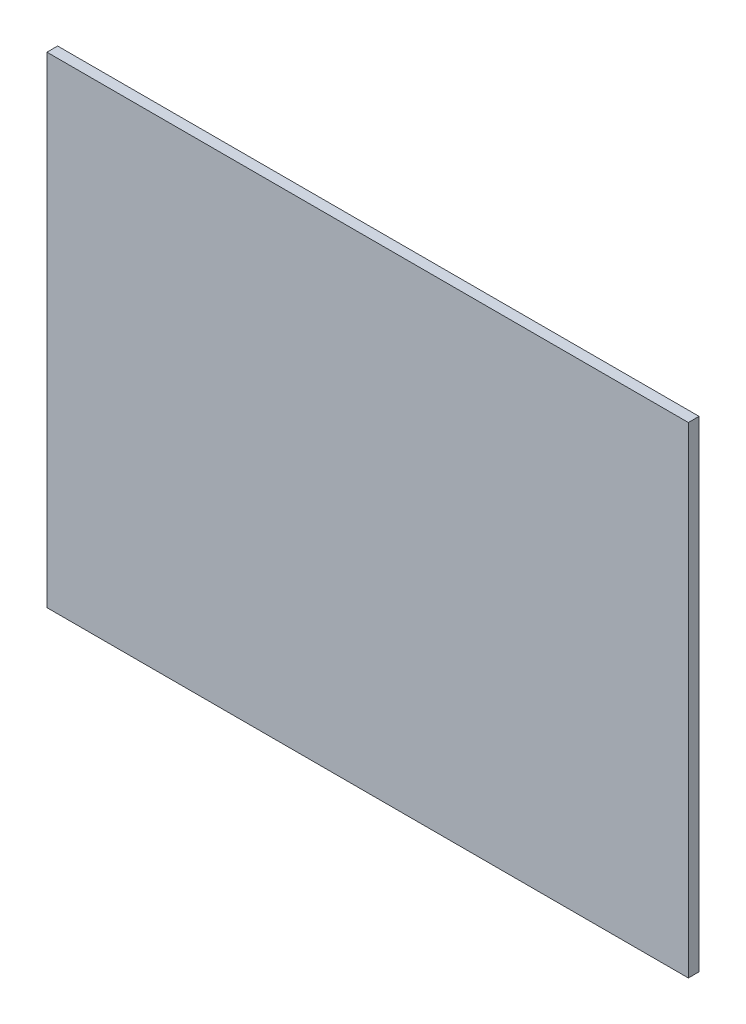
ISO-10303-21;
HEADER;
FILE_DESCRIPTION(('STEP AP214'),'2;1');
FILE_NAME('part.step','',(''),(''),'','','');
FILE_SCHEMA(('AUTOMOTIVE_DESIGN { 1 0 10303 214 1 1 1 1 }'));
ENDSEC;
DATA;
#1=APPLICATION_CONTEXT('core data for automotive mechanical design processes');
#2=APPLICATION_PROTOCOL_DEFINITION('international standard','automotive_design',2000,#1);
#3=PRODUCT_CONTEXT('',#1,'mechanical');
#4=PRODUCT('Part','Part','',(#3));
#5=PRODUCT_RELATED_PRODUCT_CATEGORY('part','',(#4));
#6=PRODUCT_DEFINITION_FORMATION('','',#4);
#7=PRODUCT_DEFINITION_CONTEXT('part definition',#1,'design');
#8=PRODUCT_DEFINITION('design','',#6,#7);
#9=PRODUCT_DEFINITION_SHAPE('','',#8);
#10=(LENGTH_UNIT() NAMED_UNIT(*) SI_UNIT(.MILLI.,.METRE.));
#11=(NAMED_UNIT(*) PLANE_ANGLE_UNIT() SI_UNIT($,.RADIAN.));
#12=(NAMED_UNIT(*) SI_UNIT($,.STERADIAN.) SOLID_ANGLE_UNIT());
#13=UNCERTAINTY_MEASURE_WITH_UNIT(LENGTH_MEASURE(1.E-05),#10,'distance_accuracy_value','');
#14=(GEOMETRIC_REPRESENTATION_CONTEXT(3) GLOBAL_UNCERTAINTY_ASSIGNED_CONTEXT((#13)) GLOBAL_UNIT_ASSIGNED_CONTEXT((#10,
#11,#12)) REPRESENTATION_CONTEXT('',''));
#15=CARTESIAN_POINT('',(0.,0.,0.));
#16=DIRECTION('',(0.,0.,1.));
#17=DIRECTION('',(1.,0.,0.));
#18=AXIS2_PLACEMENT_3D('',#15,#16,#17);
#19=CARTESIAN_POINT('',(-61.8017838452004,-407.030121654501,10.));
#20=DIRECTION('',(1.,0.,0.));
#21=DIRECTION('',(0.,0.,-1.));
#22=AXIS2_PLACEMENT_3D('',#19,#20,#21);
#23=PLANE('',#22);
#24=DIRECTION('',(0.,-1.,0.));
#25=VECTOR('',#24,1.);
#26=CARTESIAN_POINT('',(-61.8017838452004,-407.030121654501,0.));
#27=LINE('',#26,#25);
#28=CARTESIAN_POINT('',(-61.8017838452004,42.9698783454988,0.));
#29=VERTEX_POINT('',#28);
#30=CARTESIAN_POINT('',(-61.8017838452004,-407.030121654501,0.));
#31=VERTEX_POINT('',#30);
#32=EDGE_CURVE('E96',#29,#31,#27,.T.);
#33=ORIENTED_EDGE('',*,*,#32,.T.);
#34=DIRECTION('',(0.,0.,-1.));
#35=VECTOR('',#34,1.);
#36=CARTESIAN_POINT('',(-61.8017838452004,-407.030121654501,10.));
#37=LINE('',#36,#35);
#38=CARTESIAN_POINT('',(-61.8017838452004,-407.030121654501,10.));
#39=VERTEX_POINT('',#38);
#40=EDGE_CURVE('E11',#39,#31,#37,.T.);
#41=ORIENTED_EDGE('',*,*,#40,.F.);
#42=DIRECTION('',(0.,-1.,0.));
#43=VECTOR('',#42,1.);
#44=CARTESIAN_POINT('',(-61.8017838452004,-407.030121654501,10.));
#45=LINE('',#44,#43);
#46=CARTESIAN_POINT('',(-61.8017838452004,42.9698783454988,10.));
#47=VERTEX_POINT('',#46);
#48=EDGE_CURVE('E84',#47,#39,#45,.T.);
#49=ORIENTED_EDGE('',*,*,#48,.F.);
#50=DIRECTION('',(0.,0.,-1.));
#51=VECTOR('',#50,1.);
#52=CARTESIAN_POINT('',(-61.8017838452004,42.9698783454988,10.));
#53=LINE('',#52,#51);
#54=EDGE_CURVE('E92',#47,#29,#53,.T.);
#55=ORIENTED_EDGE('',*,*,#54,.T.);
#56=EDGE_LOOP('',(#33,#41,#49,#55));
#57=FACE_BOUND('',#56,.T.);
#58=ADVANCED_FACE('F33',(#57),#23,.F.);
#59=CARTESIAN_POINT('',(538.1982161548,-407.030121654501,10.));
#60=DIRECTION('',(0.,1.,0.));
#61=DIRECTION('',(0.,0.,1.));
#62=AXIS2_PLACEMENT_3D('',#59,#60,#61);
#63=PLANE('',#62);
#64=DIRECTION('',(1.,0.,0.));
#65=VECTOR('',#64,1.);
#66=CARTESIAN_POINT('',(538.1982161548,-407.030121654501,0.));
#67=LINE('',#66,#65);
#68=CARTESIAN_POINT('',(538.1982161548,-407.030121654501,0.));
#69=VERTEX_POINT('',#68);
#70=EDGE_CURVE('E88',#31,#69,#67,.T.);
#71=ORIENTED_EDGE('',*,*,#70,.T.);
#72=DIRECTION('',(0.,0.,-1.));
#73=VECTOR('',#72,1.);
#74=CARTESIAN_POINT('',(538.1982161548,-407.030121654501,10.));
#75=LINE('',#74,#73);
#76=CARTESIAN_POINT('',(538.1982161548,-407.030121654501,10.));
#77=VERTEX_POINT('',#76);
#78=EDGE_CURVE('E41',#77,#69,#75,.T.);
#79=ORIENTED_EDGE('',*,*,#78,.F.);
#80=DIRECTION('',(1.,0.,0.));
#81=VECTOR('',#80,1.);
#82=CARTESIAN_POINT('',(538.1982161548,-407.030121654501,10.));
#83=LINE('',#82,#81);
#84=EDGE_CURVE('E79',#39,#77,#83,.T.);
#85=ORIENTED_EDGE('',*,*,#84,.F.);
#86=ORIENTED_EDGE('',*,*,#40,.T.);
#87=EDGE_LOOP('',(#71,#79,#85,#86));
#88=FACE_BOUND('',#87,.T.);
#89=ADVANCED_FACE('F87',(#88),#63,.F.);
#90=CARTESIAN_POINT('',(538.1982161548,42.9698783454988,10.));
#91=DIRECTION('',(-1.,0.,0.));
#92=DIRECTION('',(0.,0.,1.));
#93=AXIS2_PLACEMENT_3D('',#90,#91,#92);
#94=PLANE('',#93);
#95=DIRECTION('',(0.,1.,0.));
#96=VECTOR('',#95,1.);
#97=CARTESIAN_POINT('',(538.1982161548,42.9698783454988,0.));
#98=LINE('',#97,#96);
#99=CARTESIAN_POINT('',(538.1982161548,42.9698783454988,0.));
#100=VERTEX_POINT('',#99);
#101=EDGE_CURVE('E66',#69,#100,#98,.T.);
#102=ORIENTED_EDGE('',*,*,#101,.T.);
#103=DIRECTION('',(0.,0.,-1.));
#104=VECTOR('',#103,1.);
#105=CARTESIAN_POINT('',(538.1982161548,42.9698783454988,10.));
#106=LINE('',#105,#104);
#107=CARTESIAN_POINT('',(538.1982161548,42.9698783454988,10.));
#108=VERTEX_POINT('',#107);
#109=EDGE_CURVE('E89',#108,#100,#106,.T.);
#110=ORIENTED_EDGE('',*,*,#109,.F.);
#111=DIRECTION('',(0.,1.,0.));
#112=VECTOR('',#111,1.);
#113=CARTESIAN_POINT('',(538.1982161548,42.9698783454988,10.));
#114=LINE('',#113,#112);
#115=EDGE_CURVE('E82',#77,#108,#114,.T.);
#116=ORIENTED_EDGE('',*,*,#115,.F.);
#117=ORIENTED_EDGE('',*,*,#78,.T.);
#118=EDGE_LOOP('',(#102,#110,#116,#117));
#119=FACE_BOUND('',#118,.T.);
#120=ADVANCED_FACE('F90',(#119),#94,.F.);
#121=CARTESIAN_POINT('',(-61.8017838452004,42.9698783454988,10.));
#122=DIRECTION('',(0.,-1.,0.));
#123=DIRECTION('',(0.,0.,-1.));
#124=AXIS2_PLACEMENT_3D('',#121,#122,#123);
#125=PLANE('',#124);
#126=DIRECTION('',(-1.,0.,0.));
#127=VECTOR('',#126,1.);
#128=CARTESIAN_POINT('',(-61.8017838452004,42.9698783454988,0.));
#129=LINE('',#128,#127);
#130=EDGE_CURVE('E72',#100,#29,#129,.T.);
#131=ORIENTED_EDGE('',*,*,#130,.T.);
#132=ORIENTED_EDGE('',*,*,#54,.F.);
#133=DIRECTION('',(-1.,0.,0.));
#134=VECTOR('',#133,1.);
#135=CARTESIAN_POINT('',(-61.8017838452004,42.9698783454988,10.));
#136=LINE('',#135,#134);
#137=EDGE_CURVE('E49',#108,#47,#136,.T.);
#138=ORIENTED_EDGE('',*,*,#137,.F.);
#139=ORIENTED_EDGE('',*,*,#109,.T.);
#140=EDGE_LOOP('',(#131,#132,#138,#139));
#141=FACE_BOUND('',#140,.T.);
#142=ADVANCED_FACE('F103',(#141),#125,.F.);
#143=CARTESIAN_POINT('',(0.,0.,10.));
#144=DIRECTION('',(0.,0.,-1.));
#145=DIRECTION('',(-1.,0.,0.));
#146=AXIS2_PLACEMENT_3D('',#143,#144,#145);
#147=PLANE('',#146);
#148=ORIENTED_EDGE('',*,*,#48,.T.);
#149=ORIENTED_EDGE('',*,*,#84,.T.);
#150=ORIENTED_EDGE('',*,*,#115,.T.);
#151=ORIENTED_EDGE('',*,*,#137,.T.);
#152=EDGE_LOOP('',(#148,#149,#150,#151));
#153=FACE_BOUND('',#152,.T.);
#154=ADVANCED_FACE('F80',(#153),#147,.F.);
#155=CARTESIAN_POINT('',(0.,0.,0.));
#156=DIRECTION('',(0.,0.,-1.));
#157=DIRECTION('',(-1.,0.,0.));
#158=AXIS2_PLACEMENT_3D('',#155,#156,#157);
#159=PLANE('',#158);
#160=ORIENTED_EDGE('',*,*,#32,.F.);
#161=ORIENTED_EDGE('',*,*,#130,.F.);
#162=ORIENTED_EDGE('',*,*,#101,.F.);
#163=ORIENTED_EDGE('',*,*,#70,.F.);
#164=EDGE_LOOP('',(#160,#161,#162,#163));
#165=FACE_BOUND('',#164,.T.);
#166=ADVANCED_FACE('F106',(#165),#159,.T.);
#167=CLOSED_SHELL('',(#58,#89,#120,#142,#154,#166));
#168=MANIFOLD_SOLID_BREP('B2',#167);
#169=ADVANCED_BREP_SHAPE_REPRESENTATION('',(#18,#168),#14);
#170=SHAPE_DEFINITION_REPRESENTATION(#9,#169);
ENDSEC;
END-ISO-10303-21;
